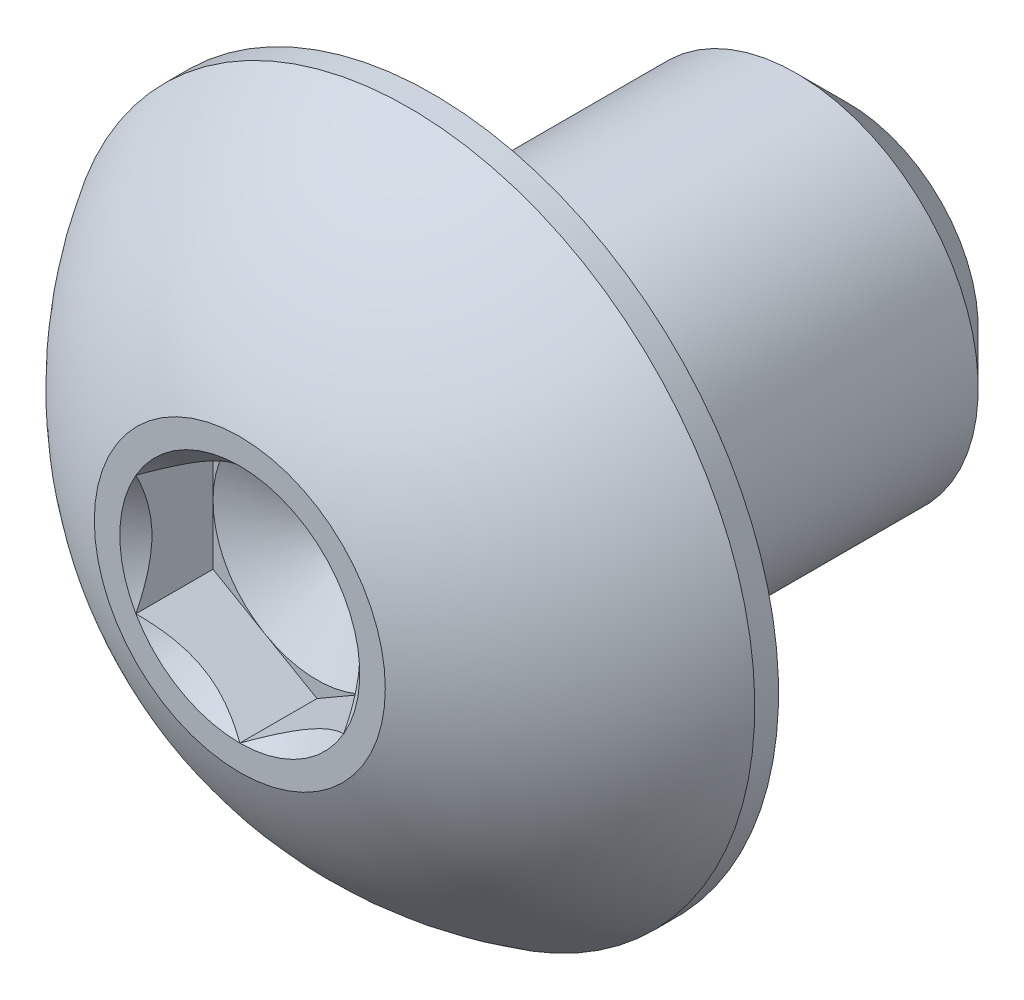
ISO-10303-21;
HEADER;
FILE_DESCRIPTION(('STEP AP214'),'2;1');
FILE_NAME('part.step','',(''),(''),'','','');
FILE_SCHEMA(('AUTOMOTIVE_DESIGN { 1 0 10303 214 1 1 1 1 }'));
ENDSEC;
DATA;
#1=APPLICATION_CONTEXT('core data for automotive mechanical design processes');
#2=APPLICATION_PROTOCOL_DEFINITION('international standard','automotive_design',2000,#1);
#3=PRODUCT_CONTEXT('',#1,'mechanical');
#4=PRODUCT('Part','Part','',(#3));
#5=PRODUCT_RELATED_PRODUCT_CATEGORY('part','',(#4));
#6=PRODUCT_DEFINITION_FORMATION('','',#4);
#7=PRODUCT_DEFINITION_CONTEXT('part definition',#1,'design');
#8=PRODUCT_DEFINITION('design','',#6,#7);
#9=PRODUCT_DEFINITION_SHAPE('','',#8);
#10=(LENGTH_UNIT() NAMED_UNIT(*) SI_UNIT(.MILLI.,.METRE.));
#11=(NAMED_UNIT(*) PLANE_ANGLE_UNIT() SI_UNIT($,.RADIAN.));
#12=(NAMED_UNIT(*) SI_UNIT($,.STERADIAN.) SOLID_ANGLE_UNIT());
#13=UNCERTAINTY_MEASURE_WITH_UNIT(LENGTH_MEASURE(1.E-05),#10,'distance_accuracy_value','');
#14=(GEOMETRIC_REPRESENTATION_CONTEXT(3) GLOBAL_UNCERTAINTY_ASSIGNED_CONTEXT((#13)) GLOBAL_UNIT_ASSIGNED_CONTEXT((#10,
#11,#12)) REPRESENTATION_CONTEXT('',''));
#15=CARTESIAN_POINT('',(0.,0.,0.));
#16=DIRECTION('',(0.,0.,1.));
#17=DIRECTION('',(1.,0.,0.));
#18=AXIS2_PLACEMENT_3D('',#15,#16,#17);
#19=CARTESIAN_POINT('',(0.,0.,2.60223));
#20=DIRECTION('',(0.,0.,1.));
#21=DIRECTION('',(1.,0.,0.));
#22=AXIS2_PLACEMENT_3D('',#19,#20,#21);
#23=PLANE('',#22);
#24=DIRECTION('',(0.,1.,0.));
#25=VECTOR('',#24,1.);
#26=CARTESIAN_POINT('',(-1.190625,0.687407664253898,2.60223));
#27=LINE('',#26,#25);
#28=CARTESIAN_POINT('',(-1.190625,-0.687407664253899,2.60223));
#29=VERTEX_POINT('',#28);
#30=CARTESIAN_POINT('',(-1.1906249999678,2.16066967707726E-13,2.60222999997774));
#31=VERTEX_POINT('',#30);
#32=EDGE_CURVE('E11',#29,#31,#27,.T.);
#33=ORIENTED_EDGE('',*,*,#32,.F.);
#34=DIRECTION('',(-0.866025403784439,0.5,0.));
#35=VECTOR('',#34,1.);
#36=CARTESIAN_POINT('',(-1.190625,-0.687407664253899,2.60223));
#37=LINE('',#36,#35);
#38=CARTESIAN_POINT('',(-0.595312499983901,-1.03111149635297,2.60222999997774));
#39=VERTEX_POINT('',#38);
#40=EDGE_CURVE('E214',#39,#29,#37,.T.);
#41=ORIENTED_EDGE('',*,*,#40,.F.);
#42=CARTESIAN_POINT('',(0.,0.,2.60222999995547));
#43=DIRECTION('',(0.,0.,-1.));
#44=DIRECTION('',(1.,0.,0.));
#45=AXIS2_PLACEMENT_3D('',#42,#43,#44);
#46=CIRCLE('',#45,1.19062499993561);
#47=EDGE_CURVE('E267',#39,#31,#46,.T.);
#48=ORIENTED_EDGE('',*,*,#47,.T.);
#49=EDGE_LOOP('',(#33,#41,#48));
#50=FACE_BOUND('',#49,.T.);
#51=ADVANCED_FACE('F16',(#50),#23,.T.);
#52=CARTESIAN_POINT('',(0.,0.,2.60223));
#53=DIRECTION('',(0.,0.,1.));
#54=DIRECTION('',(1.,0.,0.));
#55=AXIS2_PLACEMENT_3D('',#52,#53,#54);
#56=PLANE('',#55);
#57=DIRECTION('',(-0.866025403784439,0.5,0.));
#58=VECTOR('',#57,1.);
#59=CARTESIAN_POINT('',(-1.190625,-0.687407664253899,2.60223));
#60=LINE('',#59,#58);
#61=CARTESIAN_POINT('',(0.,-1.3748153285078,2.60223));
#62=VERTEX_POINT('',#61);
#63=EDGE_CURVE('E213',#62,#39,#60,.T.);
#64=ORIENTED_EDGE('',*,*,#63,.F.);
#65=DIRECTION('',(-0.866025403784439,-0.5,0.));
#66=VECTOR('',#65,1.);
#67=CARTESIAN_POINT('',(0.,-1.3748153285078,2.60223));
#68=LINE('',#67,#66);
#69=CARTESIAN_POINT('',(0.595312499983902,-1.03111149635296,2.60222999997774));
#70=VERTEX_POINT('',#69);
#71=EDGE_CURVE('E167',#70,#62,#68,.T.);
#72=ORIENTED_EDGE('',*,*,#71,.F.);
#73=CARTESIAN_POINT('',(0.,0.,2.60222999995547));
#74=DIRECTION('',(0.,0.,-1.));
#75=DIRECTION('',(1.,0.,0.));
#76=AXIS2_PLACEMENT_3D('',#73,#74,#75);
#77=CIRCLE('',#76,1.19062499993561);
#78=EDGE_CURVE('E262',#70,#39,#77,.T.);
#79=ORIENTED_EDGE('',*,*,#78,.T.);
#80=EDGE_LOOP('',(#64,#72,#79));
#81=FACE_BOUND('',#80,.T.);
#82=ADVANCED_FACE('F479',(#81),#56,.T.);
#83=CARTESIAN_POINT('',(0.,0.,2.60223));
#84=DIRECTION('',(0.,0.,1.));
#85=DIRECTION('',(1.,0.,0.));
#86=AXIS2_PLACEMENT_3D('',#83,#84,#85);
#87=PLANE('',#86);
#88=DIRECTION('',(-0.866025403784439,-0.5,0.));
#89=VECTOR('',#88,1.);
#90=CARTESIAN_POINT('',(0.,-1.3748153285078,2.60223));
#91=LINE('',#90,#89);
#92=CARTESIAN_POINT('',(1.190625,-0.687407664253898,2.60223));
#93=VERTEX_POINT('',#92);
#94=EDGE_CURVE('E339',#93,#70,#91,.T.);
#95=ORIENTED_EDGE('',*,*,#94,.F.);
#96=DIRECTION('',(0.,-1.,0.));
#97=VECTOR('',#96,1.);
#98=CARTESIAN_POINT('',(1.190625,-0.687407664253898,2.60223));
#99=LINE('',#98,#97);
#100=CARTESIAN_POINT('',(1.1906249999678,0.,2.60222999997774));
#101=VERTEX_POINT('',#100);
#102=EDGE_CURVE('E205',#101,#93,#99,.T.);
#103=ORIENTED_EDGE('',*,*,#102,.F.);
#104=CARTESIAN_POINT('',(0.,0.,2.60222999995547));
#105=DIRECTION('',(0.,0.,-1.));
#106=DIRECTION('',(1.,0.,0.));
#107=AXIS2_PLACEMENT_3D('',#104,#105,#106);
#108=CIRCLE('',#107,1.19062499993561);
#109=EDGE_CURVE('E266',#101,#70,#108,.T.);
#110=ORIENTED_EDGE('',*,*,#109,.T.);
#111=EDGE_LOOP('',(#95,#103,#110));
#112=FACE_BOUND('',#111,.T.);
#113=ADVANCED_FACE('F484',(#112),#87,.T.);
#114=CARTESIAN_POINT('',(0.,0.,2.60223));
#115=DIRECTION('',(0.,0.,1.));
#116=DIRECTION('',(1.,0.,0.));
#117=AXIS2_PLACEMENT_3D('',#114,#115,#116);
#118=PLANE('',#117);
#119=DIRECTION('',(0.,-1.,0.));
#120=VECTOR('',#119,1.);
#121=CARTESIAN_POINT('',(1.190625,-0.687407664253898,2.60223));
#122=LINE('',#121,#120);
#123=CARTESIAN_POINT('',(1.190625,0.687407664253899,2.60223));
#124=VERTEX_POINT('',#123);
#125=EDGE_CURVE('E154',#124,#101,#122,.T.);
#126=ORIENTED_EDGE('',*,*,#125,.F.);
#127=DIRECTION('',(0.866025403784439,-0.5,0.));
#128=VECTOR('',#127,1.);
#129=CARTESIAN_POINT('',(1.190625,0.687407664253899,2.60223));
#130=LINE('',#129,#128);
#131=CARTESIAN_POINT('',(0.595312499983901,1.03111149635297,2.60222999997774));
#132=VERTEX_POINT('',#131);
#133=EDGE_CURVE('E158',#132,#124,#130,.T.);
#134=ORIENTED_EDGE('',*,*,#133,.F.);
#135=CARTESIAN_POINT('',(0.,0.,2.60222999995547));
#136=DIRECTION('',(0.,0.,-1.));
#137=DIRECTION('',(1.,0.,0.));
#138=AXIS2_PLACEMENT_3D('',#135,#136,#137);
#139=CIRCLE('',#138,1.19062499993561);
#140=EDGE_CURVE('E161',#132,#101,#139,.T.);
#141=ORIENTED_EDGE('',*,*,#140,.T.);
#142=EDGE_LOOP('',(#126,#134,#141));
#143=FACE_BOUND('',#142,.T.);
#144=ADVANCED_FACE('F156',(#143),#118,.T.);
#145=CARTESIAN_POINT('',(0.,0.,2.60223));
#146=DIRECTION('',(0.,0.,1.));
#147=DIRECTION('',(1.,0.,0.));
#148=AXIS2_PLACEMENT_3D('',#145,#146,#147);
#149=PLANE('',#148);
#150=DIRECTION('',(0.866025403784439,0.5,0.));
#151=VECTOR('',#150,1.);
#152=CARTESIAN_POINT('',(0.,1.3748153285078,2.60223));
#153=LINE('',#152,#151);
#154=CARTESIAN_POINT('',(-1.190625,0.687407664253898,2.60223));
#155=VERTEX_POINT('',#154);
#156=CARTESIAN_POINT('',(-0.595312499983902,1.03111149635296,2.60222999997774));
#157=VERTEX_POINT('',#156);
#158=EDGE_CURVE('E145',#155,#157,#153,.T.);
#159=ORIENTED_EDGE('',*,*,#158,.F.);
#160=DIRECTION('',(0.,1.,0.));
#161=VECTOR('',#160,1.);
#162=CARTESIAN_POINT('',(-1.190625,0.687407664253898,2.60223));
#163=LINE('',#162,#161);
#164=EDGE_CURVE('E27',#31,#155,#163,.T.);
#165=ORIENTED_EDGE('',*,*,#164,.F.);
#166=CARTESIAN_POINT('',(0.,0.,2.60222999995547));
#167=DIRECTION('',(0.,0.,-1.));
#168=DIRECTION('',(1.,0.,0.));
#169=AXIS2_PLACEMENT_3D('',#166,#167,#168);
#170=CIRCLE('',#169,1.19062499993561);
#171=EDGE_CURVE('E246',#31,#157,#170,.T.);
#172=ORIENTED_EDGE('',*,*,#171,.T.);
#173=EDGE_LOOP('',(#159,#165,#172));
#174=FACE_BOUND('',#173,.T.);
#175=ADVANCED_FACE('F538',(#174),#149,.T.);
#176=CARTESIAN_POINT('',(0.,0.,2.60223));
#177=DIRECTION('',(0.,0.,1.));
#178=DIRECTION('',(1.,0.,0.));
#179=AXIS2_PLACEMENT_3D('',#176,#177,#178);
#180=PLANE('',#179);
#181=DIRECTION('',(0.866025403784439,-0.5,0.));
#182=VECTOR('',#181,1.);
#183=CARTESIAN_POINT('',(1.190625,0.687407664253899,2.60223));
#184=LINE('',#183,#182);
#185=CARTESIAN_POINT('',(0.,1.3748153285078,2.60223));
#186=VERTEX_POINT('',#185);
#187=EDGE_CURVE('E179',#186,#132,#184,.T.);
#188=ORIENTED_EDGE('',*,*,#187,.F.);
#189=DIRECTION('',(0.866025403784439,0.5,0.));
#190=VECTOR('',#189,1.);
#191=CARTESIAN_POINT('',(0.,1.3748153285078,2.60223));
#192=LINE('',#191,#190);
#193=EDGE_CURVE('E257',#157,#186,#192,.T.);
#194=ORIENTED_EDGE('',*,*,#193,.F.);
#195=CARTESIAN_POINT('',(0.,0.,2.60222999995547));
#196=DIRECTION('',(0.,0.,-1.));
#197=DIRECTION('',(1.,0.,0.));
#198=AXIS2_PLACEMENT_3D('',#195,#196,#197);
#199=CIRCLE('',#198,1.19062499993561);
#200=EDGE_CURVE('E250',#157,#132,#199,.T.);
#201=ORIENTED_EDGE('',*,*,#200,.T.);
#202=EDGE_LOOP('',(#188,#194,#201));
#203=FACE_BOUND('',#202,.T.);
#204=ADVANCED_FACE('F306',(#203),#180,.T.);
#205=CARTESIAN_POINT('',(-1.190625,0.687407664253898,3.48615));
#206=DIRECTION('',(1.,0.,0.));
#207=DIRECTION('',(0.,1.,0.));
#208=AXIS2_PLACEMENT_3D('',#205,#206,#207);
#209=PLANE('',#208);
#210=ORIENTED_EDGE('',*,*,#164,.T.);
#211=DIRECTION('',(0.,0.,-1.));
#212=VECTOR('',#211,1.);
#213=CARTESIAN_POINT('',(-1.190625,0.687407664253898,3.48615));
#214=LINE('',#213,#212);
#215=CARTESIAN_POINT('',(-1.19062499995943,0.687407664264676,3.48615000003183));
#216=VERTEX_POINT('',#215);
#217=EDGE_CURVE('E106',#216,#155,#214,.T.);
#218=ORIENTED_EDGE('',*,*,#217,.F.);
#219=CARTESIAN_POINT('',(-1.190625,0.687407664250615,3.48615000005993));
#220=CARTESIAN_POINT('',(-1.190625,5.79805647937803E-12,3.14244616804419));
#221=CARTESIAN_POINT('',(-1.190625,-0.687407664235154,3.4861500000522));
#222=(BOUNDED_CURVE() B_SPLINE_CURVE(2,(#219,#220,#221),.UNSPECIFIED.,.F.,
.F.) B_SPLINE_CURVE_WITH_KNOTS((3,3),(0.126894256979399,0.347424905152073),
.UNSPECIFIED.) CURVE() GEOMETRIC_REPRESENTATION_ITEM() RATIONAL_B_SPLINE_CURVE((1.38979663224803,
1.60479891949046,1.38979663225222)) REPRESENTATION_ITEM(''));
#223=CARTESIAN_POINT('',(-1.19062499997972,-0.687407664242189,3.48615000003815));
#224=VERTEX_POINT('',#223);
#225=EDGE_CURVE('E261',#216,#224,#222,.T.);
#226=ORIENTED_EDGE('',*,*,#225,.T.);
#227=DIRECTION('',(0.,0.,1.));
#228=VECTOR('',#227,1.);
#229=CARTESIAN_POINT('',(-1.190625,-0.687407664253899,3.48615));
#230=LINE('',#229,#228);
#231=EDGE_CURVE('E116',#29,#224,#230,.T.);
#232=ORIENTED_EDGE('',*,*,#231,.F.);
#233=ORIENTED_EDGE('',*,*,#32,.T.);
#234=EDGE_LOOP('',(#210,#218,#226,#232,#233));
#235=FACE_BOUND('',#234,.T.);
#236=ADVANCED_FACE('F563',(#235),#209,.T.);
#237=CARTESIAN_POINT('',(-1.190625,-0.687407664253899,3.48615));
#238=DIRECTION('',(0.5,0.866025403784439,0.));
#239=DIRECTION('',(0.,0.,-1.));
#240=AXIS2_PLACEMENT_3D('',#237,#238,#239);
#241=PLANE('',#240);
#242=ORIENTED_EDGE('',*,*,#40,.T.);
#243=ORIENTED_EDGE('',*,*,#231,.T.);
#244=CARTESIAN_POINT('',(-1.19062499998377,-0.687407664263272,3.4861500000522));
#245=CARTESIAN_POINT('',(-0.595312499999999,-1.03111149638085,3.14244616804698));
#246=CARTESIAN_POINT('',(-1.62321981368385E-11,-1.37481532849843,3.4861500000522));
#247=(BOUNDED_CURVE() B_SPLINE_CURVE(2,(#244,#245,#246),.UNSPECIFIED.,.F.,
.F.) B_SPLINE_CURVE_WITH_KNOTS((3,3),(0.126894256981522,0.347424905152042),
.UNSPECIFIED.) CURVE() GEOMETRIC_REPRESENTATION_ITEM() RATIONAL_B_SPLINE_CURVE((1.3897966322521,
1.60479891948823,1.3897966322521)) REPRESENTATION_ITEM(''));
#248=CARTESIAN_POINT('',(0.,-1.37481532848438,3.48615000003815));
#249=VERTEX_POINT('',#248);
#250=EDGE_CURVE('E278',#224,#249,#247,.T.);
#251=ORIENTED_EDGE('',*,*,#250,.T.);
#252=DIRECTION('',(0.,0.,1.));
#253=VECTOR('',#252,1.);
#254=CARTESIAN_POINT('',(0.,-1.3748153285078,3.48615));
#255=LINE('',#254,#253);
#256=EDGE_CURVE('E337',#62,#249,#255,.T.);
#257=ORIENTED_EDGE('',*,*,#256,.F.);
#258=ORIENTED_EDGE('',*,*,#63,.T.);
#259=EDGE_LOOP('',(#242,#243,#251,#257,#258));
#260=FACE_BOUND('',#259,.T.);
#261=ADVANCED_FACE('F520',(#260),#241,.T.);
#262=CARTESIAN_POINT('',(0.,-1.3748153285078,3.48615));
#263=DIRECTION('',(-0.5,0.866025403784439,0.));
#264=DIRECTION('',(0.,0.,1.));
#265=AXIS2_PLACEMENT_3D('',#262,#263,#264);
#266=PLANE('',#265);
#267=ORIENTED_EDGE('',*,*,#71,.T.);
#268=ORIENTED_EDGE('',*,*,#256,.T.);
#269=CARTESIAN_POINT('',(1.62357929099837E-11,-1.37481532849842,3.4861500000522));
#270=CARTESIAN_POINT('',(0.5953125,-1.03111149638085,3.14244616804699));
#271=CARTESIAN_POINT('',(1.19062499998376,-0.687407664263271,3.4861500000522));
#272=(BOUNDED_CURVE() B_SPLINE_CURVE(2,(#269,#270,#271),.UNSPECIFIED.,.F.,
.F.) B_SPLINE_CURVE_WITH_KNOTS((3,3),(0.126894256981523,0.347424905152041),
.UNSPECIFIED.) CURVE() GEOMETRIC_REPRESENTATION_ITEM() RATIONAL_B_SPLINE_CURVE((1.3897966322521,
1.60479891948823,1.3897966322521)) REPRESENTATION_ITEM(''));
#273=CARTESIAN_POINT('',(1.19062499997972,-0.687407664242187,3.48615000003815));
#274=VERTEX_POINT('',#273);
#275=EDGE_CURVE('E283',#249,#274,#272,.T.);
#276=ORIENTED_EDGE('',*,*,#275,.T.);
#277=DIRECTION('',(0.,0.,1.));
#278=VECTOR('',#277,1.);
#279=CARTESIAN_POINT('',(1.190625,-0.687407664253898,3.48615));
#280=LINE('',#279,#278);
#281=EDGE_CURVE('E168',#93,#274,#280,.T.);
#282=ORIENTED_EDGE('',*,*,#281,.F.);
#283=ORIENTED_EDGE('',*,*,#94,.T.);
#284=EDGE_LOOP('',(#267,#268,#276,#282,#283));
#285=FACE_BOUND('',#284,.T.);
#286=ADVANCED_FACE('F512',(#285),#266,.T.);
#287=CARTESIAN_POINT('',(1.190625,-0.687407664253898,3.48615));
#288=DIRECTION('',(-1.,0.,0.));
#289=DIRECTION('',(0.,1.,0.));
#290=AXIS2_PLACEMENT_3D('',#287,#288,#289);
#291=PLANE('',#290);
#292=ORIENTED_EDGE('',*,*,#102,.T.);
#293=ORIENTED_EDGE('',*,*,#281,.T.);
#294=CARTESIAN_POINT('',(1.190625,-0.687407664235152,3.4861500000522));
#295=CARTESIAN_POINT('',(1.190625,0.,3.14244616804709));
#296=CARTESIAN_POINT('',(1.190625,0.687407664235153,3.4861500000522));
#297=(BOUNDED_CURVE() B_SPLINE_CURVE(2,(#294,#295,#296),.UNSPECIFIED.,.F.,
.F.) B_SPLINE_CURVE_WITH_KNOTS((3,3),(0.126894256981548,0.347424905152074),
.UNSPECIFIED.) CURVE() GEOMETRIC_REPRESENTATION_ITEM() RATIONAL_B_SPLINE_CURVE((1.38979663225222,
1.60479891948837,1.38979663225222)) REPRESENTATION_ITEM(''));
#298=CARTESIAN_POINT('',(1.19062499997972,0.687407664242187,3.48615000003815));
#299=VERTEX_POINT('',#298);
#300=EDGE_CURVE('E174',#274,#299,#297,.T.);
#301=ORIENTED_EDGE('',*,*,#300,.T.);
#302=DIRECTION('',(0.,0.,1.));
#303=VECTOR('',#302,1.);
#304=CARTESIAN_POINT('',(1.190625,0.687407664253899,3.48615));
#305=LINE('',#304,#303);
#306=EDGE_CURVE('E171',#124,#299,#305,.T.);
#307=ORIENTED_EDGE('',*,*,#306,.F.);
#308=ORIENTED_EDGE('',*,*,#125,.T.);
#309=EDGE_LOOP('',(#292,#293,#301,#307,#308));
#310=FACE_BOUND('',#309,.T.);
#311=ADVANCED_FACE('F172',(#310),#291,.T.);
#312=CARTESIAN_POINT('',(1.190625,0.687407664253899,3.48615));
#313=DIRECTION('',(-0.5,-0.866025403784439,0.));
#314=DIRECTION('',(-0.866025403784439,0.5,0.));
#315=AXIS2_PLACEMENT_3D('',#312,#313,#314);
#316=PLANE('',#315);
#317=ORIENTED_EDGE('',*,*,#133,.T.);
#318=ORIENTED_EDGE('',*,*,#306,.T.);
#319=CARTESIAN_POINT('',(1.19062499998377,0.687407664263272,3.4861500000522));
#320=CARTESIAN_POINT('',(0.5953125,1.03111149638085,3.14244616804698));
#321=CARTESIAN_POINT('',(1.62335162203251E-11,1.37481532849842,3.4861500000522));
#322=(BOUNDED_CURVE() B_SPLINE_CURVE(2,(#319,#320,#321),.UNSPECIFIED.,.F.,
.F.) B_SPLINE_CURVE_WITH_KNOTS((3,3),(0.126894256981522,0.347424905152042),
.UNSPECIFIED.) CURVE() GEOMETRIC_REPRESENTATION_ITEM() RATIONAL_B_SPLINE_CURVE((1.3897966322521,
1.60479891948823,1.3897966322521)) REPRESENTATION_ITEM(''));
#323=CARTESIAN_POINT('',(0.,1.37481532848438,3.48615000003815));
#324=VERTEX_POINT('',#323);
#325=EDGE_CURVE('E199',#299,#324,#322,.T.);
#326=ORIENTED_EDGE('',*,*,#325,.T.);
#327=DIRECTION('',(0.,0.,1.));
#328=VECTOR('',#327,1.);
#329=CARTESIAN_POINT('',(0.,1.3748153285078,3.48615));
#330=LINE('',#329,#328);
#331=EDGE_CURVE('E260',#186,#324,#330,.T.);
#332=ORIENTED_EDGE('',*,*,#331,.F.);
#333=ORIENTED_EDGE('',*,*,#187,.T.);
#334=EDGE_LOOP('',(#317,#318,#326,#332,#333));
#335=FACE_BOUND('',#334,.T.);
#336=ADVANCED_FACE('F180',(#335),#316,.T.);
#337=CARTESIAN_POINT('',(0.,1.3748153285078,3.48615));
#338=DIRECTION('',(0.5,-0.866025403784439,0.));
#339=DIRECTION('',(0.,0.,-1.));
#340=AXIS2_PLACEMENT_3D('',#337,#338,#339);
#341=PLANE('',#340);
#342=ORIENTED_EDGE('',*,*,#193,.T.);
#343=ORIENTED_EDGE('',*,*,#331,.T.);
#344=CARTESIAN_POINT('',(-1.62343550007256E-11,1.37481532849842,3.4861500000522));
#345=CARTESIAN_POINT('',(-0.595312499991694,1.03111149638564,3.14244616805178));
#346=CARTESIAN_POINT('',(-1.19062499996161,0.687407664276059,3.48615000003941));
#347=(BOUNDED_CURVE() B_SPLINE_CURVE(2,(#344,#345,#346),.UNSPECIFIED.,.F.,
.F.) B_SPLINE_CURVE_WITH_KNOTS((3,3),(0.126894256981523,0.347424905148488),
.UNSPECIFIED.) CURVE() GEOMETRIC_REPRESENTATION_ITEM() RATIONAL_B_SPLINE_CURVE((1.3897966322521,
1.60479891948476,1.38979663225903)) REPRESENTATION_ITEM(''));
#348=EDGE_CURVE('E204',#324,#216,#347,.T.);
#349=ORIENTED_EDGE('',*,*,#348,.T.);
#350=ORIENTED_EDGE('',*,*,#217,.T.);
#351=ORIENTED_EDGE('',*,*,#158,.T.);
#352=EDGE_LOOP('',(#342,#343,#349,#350,#351));
#353=FACE_BOUND('',#352,.T.);
#354=ADVANCED_FACE('F464',(#353),#341,.T.);
#355=CARTESIAN_POINT('',(0.,0.,3.48615000012842));
#356=DIRECTION('',(0.,0.,1.));
#357=DIRECTION('',(0.,-1.,0.));
#358=AXIS2_PLACEMENT_3D('',#355,#356,#357);
#359=CONICAL_SURFACE('',#358,1.37481532857464,0.785398163550829);
#360=ORIENTED_EDGE('',*,*,#225,.F.);
#361=CARTESIAN_POINT('',(0.,0.,3.48615000001473));
#362=DIRECTION('',(0.,0.,1.));
#363=DIRECTION('',(0.,-1.,0.));
#364=AXIS2_PLACEMENT_3D('',#361,#362,#363);
#365=CIRCLE('',#364,1.37481532846095);
#366=EDGE_CURVE('E277',#216,#224,#365,.T.);
#367=ORIENTED_EDGE('',*,*,#366,.T.);
#368=EDGE_LOOP('',(#360,#367));
#369=FACE_BOUND('',#368,.T.);
#370=ADVANCED_FACE('F458',(#369),#359,.F.);
#371=CARTESIAN_POINT('',(0.,0.,3.48615000012842));
#372=DIRECTION('',(0.,0.,1.));
#373=DIRECTION('',(0.,-1.,0.));
#374=AXIS2_PLACEMENT_3D('',#371,#372,#373);
#375=CONICAL_SURFACE('',#374,1.37481532857464,0.785398163550677);
#376=ORIENTED_EDGE('',*,*,#250,.F.);
#377=CARTESIAN_POINT('',(0.,0.,3.48615000001473));
#378=DIRECTION('',(0.,0.,1.));
#379=DIRECTION('',(0.,-1.,0.));
#380=AXIS2_PLACEMENT_3D('',#377,#378,#379);
#381=CIRCLE('',#380,1.37481532846095);
#382=EDGE_CURVE('E197',#224,#249,#381,.T.);
#383=ORIENTED_EDGE('',*,*,#382,.T.);
#384=EDGE_LOOP('',(#376,#383));
#385=FACE_BOUND('',#384,.T.);
#386=ADVANCED_FACE('F463',(#385),#375,.F.);
#387=CARTESIAN_POINT('',(0.,0.,3.48615000012842));
#388=DIRECTION('',(0.,0.,1.));
#389=DIRECTION('',(0.,-1.,0.));
#390=AXIS2_PLACEMENT_3D('',#387,#388,#389);
#391=CONICAL_SURFACE('',#390,1.37481532857464,0.785398163550677);
#392=ORIENTED_EDGE('',*,*,#275,.F.);
#393=CARTESIAN_POINT('',(0.,0.,3.48615000001473));
#394=DIRECTION('',(0.,0.,1.));
#395=DIRECTION('',(0.,-1.,0.));
#396=AXIS2_PLACEMENT_3D('',#393,#394,#395);
#397=CIRCLE('',#396,1.37481532846095);
#398=EDGE_CURVE('E193',#249,#274,#397,.T.);
#399=ORIENTED_EDGE('',*,*,#398,.T.);
#400=EDGE_LOOP('',(#392,#399));
#401=FACE_BOUND('',#400,.T.);
#402=ADVANCED_FACE('F451',(#401),#391,.F.);
#403=CARTESIAN_POINT('',(0.,0.,3.48615000012842));
#404=DIRECTION('',(0.,0.,1.));
#405=DIRECTION('',(0.,-1.,0.));
#406=AXIS2_PLACEMENT_3D('',#403,#404,#405);
#407=CONICAL_SURFACE('',#406,1.37481532857464,0.785398163550835);
#408=ORIENTED_EDGE('',*,*,#300,.F.);
#409=CARTESIAN_POINT('',(0.,0.,3.48615000001473));
#410=DIRECTION('',(0.,0.,1.));
#411=DIRECTION('',(0.,-1.,0.));
#412=AXIS2_PLACEMENT_3D('',#409,#410,#411);
#413=CIRCLE('',#412,1.37481532846095);
#414=EDGE_CURVE('E198',#274,#299,#413,.T.);
#415=ORIENTED_EDGE('',*,*,#414,.T.);
#416=EDGE_LOOP('',(#408,#415));
#417=FACE_BOUND('',#416,.T.);
#418=ADVANCED_FACE('F445',(#417),#407,.F.);
#419=CARTESIAN_POINT('',(0.,0.,3.48615000012842));
#420=DIRECTION('',(0.,0.,1.));
#421=DIRECTION('',(0.,-1.,0.));
#422=AXIS2_PLACEMENT_3D('',#419,#420,#421);
#423=CONICAL_SURFACE('',#422,1.37481532857464,0.785398163550677);
#424=ORIENTED_EDGE('',*,*,#325,.F.);
#425=CARTESIAN_POINT('',(0.,0.,3.48615000001473));
#426=DIRECTION('',(0.,0.,1.));
#427=DIRECTION('',(0.,-1.,0.));
#428=AXIS2_PLACEMENT_3D('',#425,#426,#427);
#429=CIRCLE('',#428,1.37481532846095);
#430=EDGE_CURVE('E215',#299,#324,#429,.T.);
#431=ORIENTED_EDGE('',*,*,#430,.T.);
#432=EDGE_LOOP('',(#424,#431));
#433=FACE_BOUND('',#432,.T.);
#434=ADVANCED_FACE('F450',(#433),#423,.F.);
#435=CARTESIAN_POINT('',(0.,0.,3.48615000012842));
#436=DIRECTION('',(0.,0.,1.));
#437=DIRECTION('',(0.,-1.,0.));
#438=AXIS2_PLACEMENT_3D('',#435,#436,#437);
#439=CONICAL_SURFACE('',#438,1.37481532857464,0.785398163550677);
#440=ORIENTED_EDGE('',*,*,#348,.F.);
#441=CARTESIAN_POINT('',(0.,0.,3.48615000001473));
#442=DIRECTION('',(0.,0.,1.));
#443=DIRECTION('',(0.,-1.,0.));
#444=AXIS2_PLACEMENT_3D('',#441,#442,#443);
#445=CIRCLE('',#444,1.37481532846095);
#446=EDGE_CURVE('E273',#324,#216,#445,.T.);
#447=ORIENTED_EDGE('',*,*,#446,.T.);
#448=EDGE_LOOP('',(#440,#447));
#449=FACE_BOUND('',#448,.T.);
#450=ADVANCED_FACE('F549',(#449),#439,.F.);
#451=CARTESIAN_POINT('',(0.,1.190625,3.48615));
#452=DIRECTION('',(0.,0.,-1.));
#453=DIRECTION('',(0.,-1.,0.));
#454=AXIS2_PLACEMENT_3D('',#451,#452,#453);
#455=PLANE('',#454);
#456=ORIENTED_EDGE('',*,*,#430,.F.);
#457=ORIENTED_EDGE('',*,*,#414,.F.);
#458=ORIENTED_EDGE('',*,*,#398,.F.);
#459=ORIENTED_EDGE('',*,*,#382,.F.);
#460=ORIENTED_EDGE('',*,*,#366,.F.);
#461=ORIENTED_EDGE('',*,*,#446,.F.);
#462=EDGE_LOOP('',(#456,#457,#458,#459,#460,#461));
#463=FACE_BOUND('',#462,.T.);
#464=CARTESIAN_POINT('',(0.,0.,3.48615));
#465=DIRECTION('',(0.,0.,-1.));
#466=DIRECTION('',(0.,-1.,0.));
#467=AXIS2_PLACEMENT_3D('',#464,#465,#466);
#468=CIRCLE('',#467,1.666875);
#469=CARTESIAN_POINT('',(0.,-1.666875,3.48615));
#470=VERTEX_POINT('',#469);
#471=EDGE_CURVE('E134',#470,#470,#468,.T.);
#472=ORIENTED_EDGE('',*,*,#471,.F.);
#473=EDGE_LOOP('',(#472));
#474=FACE_BOUND('',#473,.T.);
#475=ADVANCED_FACE('F543',(#463,#474),#455,.F.);
#476=CARTESIAN_POINT('',(0.,1.4874875,-3.48615));
#477=DIRECTION('',(0.,0.,1.));
#478=DIRECTION('',(1.,0.,0.));
#479=AXIS2_PLACEMENT_3D('',#476,#477,#478);
#480=PLANE('',#479);
#481=CARTESIAN_POINT('',(0.,0.,-3.48615000001473));
#482=DIRECTION('',(0.,0.,1.));
#483=DIRECTION('',(1.,0.,0.));
#484=AXIS2_PLACEMENT_3D('',#481,#482,#483);
#485=CIRCLE('',#484,1.48748750001459);
#486=CARTESIAN_POINT('',(-1.48748750001459,0.,-3.48615000001473));
#487=VERTEX_POINT('',#486);
#488=EDGE_CURVE('E222',#487,#487,#485,.T.);
#489=ORIENTED_EDGE('',*,*,#488,.F.);
#490=EDGE_LOOP('',(#489));
#491=FACE_BOUND('',#490,.T.);
#492=ADVANCED_FACE('F548',(#491),#480,.F.);
#493=CARTESIAN_POINT('',(0.,0.,-0.817154317566211));
#494=DIRECTION('',(0.,1.,0.));
#495=DIRECTION('',(1.,0.,0.));
#496=AXIS2_PLACEMENT_3D('',#493,#494,#495);
#497=SPHERICAL_SURFACE('',#496,4.61485647828933);
#498=CARTESIAN_POINT('',(0.,0.,-0.817154317566211));
#499=DIRECTION('',(0.,0.,-1.));
#500=DIRECTION('',(0.,-1.,0.));
#501=AXIS2_PLACEMENT_3D('',#498,#499,#500);
#502=SPHERICAL_SURFACE('',#501,4.61485647828933);
#503=ORIENTED_EDGE('',*,*,#471,.T.);
#504=EDGE_LOOP('',(#503));
#505=FACE_BOUND('',#504,.T.);
#506=CARTESIAN_POINT('',(0.,0.,1.54849285714286));
#507=DIRECTION('',(0.,0.,-1.));
#508=DIRECTION('',(1.,0.,0.));
#509=AXIS2_PLACEMENT_3D('',#506,#507,#508);
#510=CIRCLE('',#509,3.9624);
#511=CARTESIAN_POINT('',(-3.9624,0.,1.54849285714286));
#512=VERTEX_POINT('',#511);
#513=EDGE_CURVE('E20',#512,#512,#510,.T.);
#514=ORIENTED_EDGE('',*,*,#513,.F.);
#515=EDGE_LOOP('',(#514));
#516=FACE_BOUND('',#515,.T.);
#517=ADVANCED_FACE('F528',(#505,#516),#502,.T.);
#518=CARTESIAN_POINT('',(0.,3.9624,1.27635));
#519=DIRECTION('',(0.,0.,1.));
#520=DIRECTION('',(1.,0.,0.));
#521=AXIS2_PLACEMENT_3D('',#518,#519,#520);
#522=PLANE('',#521);
#523=CARTESIAN_POINT('',(0.,0.,1.27635));
#524=DIRECTION('',(0.,0.,-1.));
#525=DIRECTION('',(1.,0.,0.));
#526=AXIS2_PLACEMENT_3D('',#523,#524,#525);
#527=CIRCLE('',#526,2.0828);
#528=CARTESIAN_POINT('',(-2.0828,0.,1.27635));
#529=VERTEX_POINT('',#528);
#530=EDGE_CURVE('E251',#529,#529,#527,.T.);
#531=ORIENTED_EDGE('',*,*,#530,.F.);
#532=EDGE_LOOP('',(#531));
#533=FACE_BOUND('',#532,.T.);
#534=CARTESIAN_POINT('',(0.,0.,1.27635));
#535=DIRECTION('',(0.,0.,1.));
#536=DIRECTION('',(1.,0.,0.));
#537=AXIS2_PLACEMENT_3D('',#534,#535,#536);
#538=CIRCLE('',#537,3.9624);
#539=CARTESIAN_POINT('',(-3.9624,0.,1.27635));
#540=VERTEX_POINT('',#539);
#541=EDGE_CURVE('E223',#540,#540,#538,.T.);
#542=ORIENTED_EDGE('',*,*,#541,.F.);
#543=EDGE_LOOP('',(#542));
#544=FACE_BOUND('',#543,.T.);
#545=ADVANCED_FACE('F504',(#533,#544),#522,.F.);
#546=CARTESIAN_POINT('',(0.,0.,2.60222999992266));
#547=DIRECTION('',(0.,0.,1.));
#548=DIRECTION('',(1.,0.,0.));
#549=AXIS2_PLACEMENT_3D('',#546,#547,#548);
#550=CONICAL_SURFACE('',#549,1.19062499987876,1.0471975512003);
#551=DIRECTION('',(-0.866025403786288,0.,0.499999999996797));
#552=VECTOR('',#551,1.);
#553=CARTESIAN_POINT('',(-1.19062499987876,0.,2.60222999992266));
#554=LINE('',#553,#552);
#555=CARTESIAN_POINT('',(0.,0.,1.91482233574463));
#556=VERTEX_POINT('',#555);
#557=EDGE_CURVE('E231',#556,#31,#554,.T.);
#558=ORIENTED_EDGE('',*,*,#557,.T.);
#559=ORIENTED_EDGE('',*,*,#47,.F.);
#560=ORIENTED_EDGE('',*,*,#78,.F.);
#561=ORIENTED_EDGE('',*,*,#109,.F.);
#562=ORIENTED_EDGE('',*,*,#140,.F.);
#563=ORIENTED_EDGE('',*,*,#200,.F.);
#564=ORIENTED_EDGE('',*,*,#171,.F.);
#565=ORIENTED_EDGE('',*,*,#557,.F.);
#566=EDGE_LOOP('',(#558,#559,#560,#561,#562,#563,#564,#565));
#567=FACE_BOUND('',#566,.T.);
#568=ADVANCED_FACE('F310',(#567),#550,.F.);
#569=CARTESIAN_POINT('',(0.,0.,-2.89083749999008));
#570=DIRECTION('',(0.,0.,1.));
#571=DIRECTION('',(1.,0.,0.));
#572=AXIS2_PLACEMENT_3D('',#569,#570,#571);
#573=CONICAL_SURFACE('',#572,2.08280000003924,0.785398163397448);
#574=CARTESIAN_POINT('',(0.,0.,-2.8908375));
#575=DIRECTION('',(0.,0.,1.));
#576=DIRECTION('',(1.,0.,0.));
#577=AXIS2_PLACEMENT_3D('',#574,#575,#576);
#578=CIRCLE('',#577,2.0828);
#579=CARTESIAN_POINT('',(-2.0828,0.,-2.8908375));
#580=VERTEX_POINT('',#579);
#581=EDGE_CURVE('E358',#580,#580,#578,.T.);
#582=ORIENTED_EDGE('',*,*,#581,.F.);
#583=DIRECTION('',(0.707106781186548,0.,-0.707106781186548));
#584=VECTOR('',#583,1.);
#585=CARTESIAN_POINT('',(-2.08280000003924,0.,-2.89083749999008));
#586=LINE('',#585,#584);
#587=EDGE_CURVE('E219',#580,#487,#586,.T.);
#588=ORIENTED_EDGE('',*,*,#587,.T.);
#589=ORIENTED_EDGE('',*,*,#488,.T.);
#590=ORIENTED_EDGE('',*,*,#587,.F.);
#591=EDGE_LOOP('',(#582,#588,#589,#590));
#592=FACE_BOUND('',#591,.T.);
#593=ADVANCED_FACE('F491',(#592),#573,.T.);
#594=CARTESIAN_POINT('',(0.,0.,3.48615));
#595=DIRECTION('',(0.,0.,1.));
#596=DIRECTION('',(1.,0.,0.));
#597=AXIS2_PLACEMENT_3D('',#594,#595,#596);
#598=CYLINDRICAL_SURFACE('',#597,3.9624);
#599=ORIENTED_EDGE('',*,*,#513,.T.);
#600=DIRECTION('',(0.,0.,-1.));
#601=VECTOR('',#600,1.);
#602=CARTESIAN_POINT('',(-3.9624,0.,3.48615));
#603=LINE('',#602,#601);
#604=EDGE_CURVE('E233',#512,#540,#603,.T.);
#605=ORIENTED_EDGE('',*,*,#604,.T.);
#606=ORIENTED_EDGE('',*,*,#541,.T.);
#607=ORIENTED_EDGE('',*,*,#604,.F.);
#608=EDGE_LOOP('',(#599,#605,#606,#607));
#609=FACE_BOUND('',#608,.T.);
#610=ADVANCED_FACE('F18',(#609),#598,.T.);
#611=CARTESIAN_POINT('',(0.,0.,3.48615));
#612=DIRECTION('',(0.,0.,1.));
#613=DIRECTION('',(1.,0.,0.));
#614=AXIS2_PLACEMENT_3D('',#611,#612,#613);
#615=CYLINDRICAL_SURFACE('',#614,2.0828);
#616=ORIENTED_EDGE('',*,*,#530,.T.);
#617=DIRECTION('',(0.,0.,-1.));
#618=VECTOR('',#617,1.);
#619=CARTESIAN_POINT('',(-2.0828,0.,3.48615));
#620=LINE('',#619,#618);
#621=EDGE_CURVE('E245',#529,#580,#620,.T.);
#622=ORIENTED_EDGE('',*,*,#621,.T.);
#623=ORIENTED_EDGE('',*,*,#581,.T.);
#624=ORIENTED_EDGE('',*,*,#621,.F.);
#625=EDGE_LOOP('',(#616,#622,#623,#624));
#626=FACE_BOUND('',#625,.T.);
#627=ADVANCED_FACE('F604',(#626),#615,.T.);
#628=CLOSED_SHELL('',(#51,#82,#113,#144,#175,#204,#236,#261,#286,#311,#336,#354,#370,#386,#402,
#418,#434,#450,#475,#492,#517,#545,#568,#593,#610,#627));
#629=MANIFOLD_SOLID_BREP('B1',#628);
#630=ADVANCED_BREP_SHAPE_REPRESENTATION('',(#18,#629),#14);
#631=SHAPE_DEFINITION_REPRESENTATION(#9,#630);
ENDSEC;
END-ISO-10303-21;
